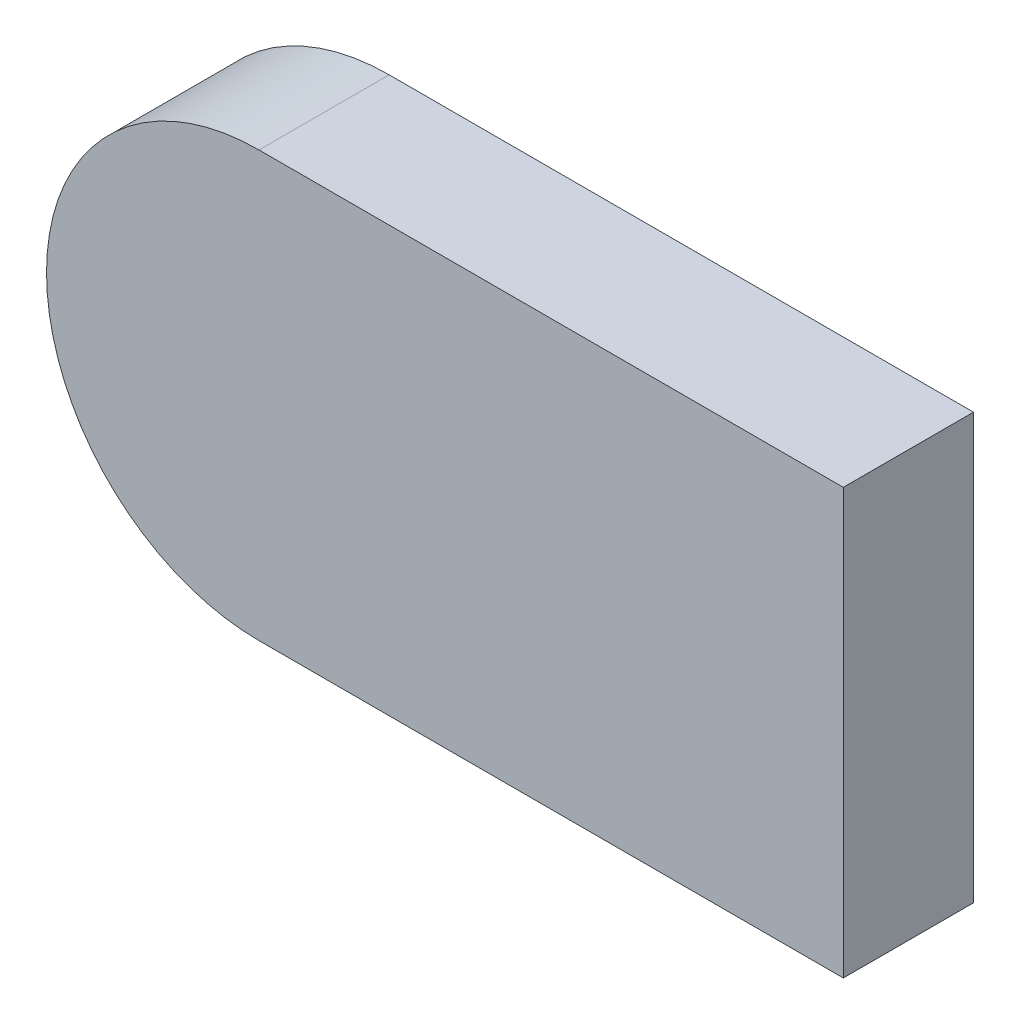
ISO-10303-21;
HEADER;
FILE_DESCRIPTION(('STEP AP214'),'2;1');
FILE_NAME('part.step','',(''),(''),'','','');
FILE_SCHEMA(('AUTOMOTIVE_DESIGN { 1 0 10303 214 1 1 1 1 }'));
ENDSEC;
DATA;
#1=APPLICATION_CONTEXT('core data for automotive mechanical design processes');
#2=APPLICATION_PROTOCOL_DEFINITION('international standard','automotive_design',2000,#1);
#3=PRODUCT_CONTEXT('',#1,'mechanical');
#4=PRODUCT('Part','Part','',(#3));
#5=PRODUCT_RELATED_PRODUCT_CATEGORY('part','',(#4));
#6=PRODUCT_DEFINITION_FORMATION('','',#4);
#7=PRODUCT_DEFINITION_CONTEXT('part definition',#1,'design');
#8=PRODUCT_DEFINITION('design','',#6,#7);
#9=PRODUCT_DEFINITION_SHAPE('','',#8);
#10=(LENGTH_UNIT() NAMED_UNIT(*) SI_UNIT(.MILLI.,.METRE.));
#11=(NAMED_UNIT(*) PLANE_ANGLE_UNIT() SI_UNIT($,.RADIAN.));
#12=(NAMED_UNIT(*) SI_UNIT($,.STERADIAN.) SOLID_ANGLE_UNIT());
#13=UNCERTAINTY_MEASURE_WITH_UNIT(LENGTH_MEASURE(1.E-05),#10,'distance_accuracy_value','');
#14=(GEOMETRIC_REPRESENTATION_CONTEXT(3) GLOBAL_UNCERTAINTY_ASSIGNED_CONTEXT((#13)) GLOBAL_UNIT_ASSIGNED_CONTEXT((#10,
#11,#12)) REPRESENTATION_CONTEXT('',''));
#15=CARTESIAN_POINT('',(0.,0.,0.));
#16=DIRECTION('',(0.,0.,1.));
#17=DIRECTION('',(1.,0.,0.));
#18=AXIS2_PLACEMENT_3D('',#15,#16,#17);
#19=CARTESIAN_POINT('',(0.,-22.5,-389.));
#20=DIRECTION('',(0.,0.,1.));
#21=DIRECTION('',(1.,0.,0.));
#22=AXIS2_PLACEMENT_3D('',#19,#20,#21);
#23=CYLINDRICAL_SURFACE('',#22,80.);
#24=DIRECTION('',(0.,0.,1.));
#25=VECTOR('',#24,1.);
#26=CARTESIAN_POINT('',(0.,57.5,-389.));
#27=LINE('',#26,#25);
#28=CARTESIAN_POINT('',(0.,57.5,-49.));
#29=VERTEX_POINT('',#28);
#30=CARTESIAN_POINT('',(0.,57.5,0.));
#31=VERTEX_POINT('',#30);
#32=EDGE_CURVE('E88',#29,#31,#27,.T.);
#33=ORIENTED_EDGE('',*,*,#32,.F.);
#34=CARTESIAN_POINT('',(0.,-22.5,-49.));
#35=DIRECTION('',(0.,0.,-1.));
#36=DIRECTION('',(-1.,0.,0.));
#37=AXIS2_PLACEMENT_3D('',#34,#35,#36);
#38=CIRCLE('',#37,80.);
#39=CARTESIAN_POINT('',(0.,-102.5,-49.));
#40=VERTEX_POINT('',#39);
#41=EDGE_CURVE('E105',#29,#40,#38,.F.);
#42=ORIENTED_EDGE('',*,*,#41,.T.);
#43=DIRECTION('',(0.,0.,1.));
#44=VECTOR('',#43,1.);
#45=CARTESIAN_POINT('',(0.,-102.5,-389.));
#46=LINE('',#45,#44);
#47=CARTESIAN_POINT('',(0.,-102.5,0.));
#48=VERTEX_POINT('',#47);
#49=EDGE_CURVE('E39',#40,#48,#46,.T.);
#50=ORIENTED_EDGE('',*,*,#49,.T.);
#51=CARTESIAN_POINT('',(0.,-22.5,0.));
#52=DIRECTION('',(0.,0.,1.));
#53=DIRECTION('',(1.,0.,0.));
#54=AXIS2_PLACEMENT_3D('',#51,#52,#53);
#55=CIRCLE('',#54,80.);
#56=EDGE_CURVE('E98',#31,#48,#55,.T.);
#57=ORIENTED_EDGE('',*,*,#56,.F.);
#58=EDGE_LOOP('',(#33,#42,#50,#57));
#59=FACE_BOUND('',#58,.T.);
#60=ADVANCED_FACE('F35',(#59),#23,.T.);
#61=CARTESIAN_POINT('',(0.,57.5,-389.));
#62=DIRECTION('',(0.,1.,0.));
#63=DIRECTION('',(-1.,0.,0.));
#64=AXIS2_PLACEMENT_3D('',#61,#62,#63);
#65=PLANE('',#64);
#66=DIRECTION('',(0.,0.,1.));
#67=VECTOR('',#66,1.);
#68=CARTESIAN_POINT('',(220.,57.5,-389.));
#69=LINE('',#68,#67);
#70=CARTESIAN_POINT('',(220.,57.5,-49.));
#71=VERTEX_POINT('',#70);
#72=CARTESIAN_POINT('',(220.,57.5,0.));
#73=VERTEX_POINT('',#72);
#74=EDGE_CURVE('E82',#71,#73,#69,.T.);
#75=ORIENTED_EDGE('',*,*,#74,.F.);
#76=DIRECTION('',(-1.,0.,0.));
#77=VECTOR('',#76,1.);
#78=CARTESIAN_POINT('',(0.,57.5,-49.));
#79=LINE('',#78,#77);
#80=EDGE_CURVE('E74',#71,#29,#79,.T.);
#81=ORIENTED_EDGE('',*,*,#80,.T.);
#82=ORIENTED_EDGE('',*,*,#32,.T.);
#83=DIRECTION('',(-1.,0.,0.));
#84=VECTOR('',#83,1.);
#85=CARTESIAN_POINT('',(0.,57.5,0.));
#86=LINE('',#85,#84);
#87=EDGE_CURVE('E94',#73,#31,#86,.T.);
#88=ORIENTED_EDGE('',*,*,#87,.F.);
#89=EDGE_LOOP('',(#75,#81,#82,#88));
#90=FACE_BOUND('',#89,.T.);
#91=ADVANCED_FACE('F97',(#90),#65,.T.);
#92=CARTESIAN_POINT('',(220.,0.,-389.));
#93=DIRECTION('',(-1.,0.,0.));
#94=DIRECTION('',(0.,-1.,0.));
#95=AXIS2_PLACEMENT_3D('',#92,#93,#94);
#96=PLANE('',#95);
#97=DIRECTION('',(0.,-1.,0.));
#98=VECTOR('',#97,1.);
#99=CARTESIAN_POINT('',(220.,0.,-49.));
#100=LINE('',#99,#98);
#101=CARTESIAN_POINT('',(220.,-102.5,-49.));
#102=VERTEX_POINT('',#101);
#103=EDGE_CURVE('E44',#71,#102,#100,.T.);
#104=ORIENTED_EDGE('',*,*,#103,.F.);
#105=ORIENTED_EDGE('',*,*,#74,.T.);
#106=DIRECTION('',(0.,-1.,0.));
#107=VECTOR('',#106,1.);
#108=CARTESIAN_POINT('',(220.,0.,0.));
#109=LINE('',#108,#107);
#110=CARTESIAN_POINT('',(220.,-102.5,0.));
#111=VERTEX_POINT('',#110);
#112=EDGE_CURVE('E85',#73,#111,#109,.T.);
#113=ORIENTED_EDGE('',*,*,#112,.T.);
#114=DIRECTION('',(0.,0.,1.));
#115=VECTOR('',#114,1.);
#116=CARTESIAN_POINT('',(220.,-102.5,-389.));
#117=LINE('',#116,#115);
#118=EDGE_CURVE('E57',#102,#111,#117,.T.);
#119=ORIENTED_EDGE('',*,*,#118,.F.);
#120=EDGE_LOOP('',(#104,#105,#113,#119));
#121=FACE_BOUND('',#120,.T.);
#122=ADVANCED_FACE('F84',(#121),#96,.F.);
#123=CARTESIAN_POINT('',(0.,-102.5,-389.));
#124=DIRECTION('',(0.,1.,0.));
#125=DIRECTION('',(-1.,0.,0.));
#126=AXIS2_PLACEMENT_3D('',#123,#124,#125);
#127=PLANE('',#126);
#128=DIRECTION('',(-1.,0.,0.));
#129=VECTOR('',#128,1.);
#130=CARTESIAN_POINT('',(0.,-102.5,-49.));
#131=LINE('',#130,#129);
#132=EDGE_CURVE('E11',#102,#40,#131,.T.);
#133=ORIENTED_EDGE('',*,*,#132,.F.);
#134=ORIENTED_EDGE('',*,*,#118,.T.);
#135=DIRECTION('',(-1.,0.,0.));
#136=VECTOR('',#135,1.);
#137=CARTESIAN_POINT('',(0.,-102.5,0.));
#138=LINE('',#137,#136);
#139=EDGE_CURVE('E95',#111,#48,#138,.T.);
#140=ORIENTED_EDGE('',*,*,#139,.T.);
#141=ORIENTED_EDGE('',*,*,#49,.F.);
#142=EDGE_LOOP('',(#133,#134,#140,#141));
#143=FACE_BOUND('',#142,.T.);
#144=ADVANCED_FACE('F109',(#143),#127,.F.);
#145=CARTESIAN_POINT('',(0.,0.,0.));
#146=DIRECTION('',(0.,0.,1.));
#147=DIRECTION('',(1.,0.,0.));
#148=AXIS2_PLACEMENT_3D('',#145,#146,#147);
#149=PLANE('',#148);
#150=ORIENTED_EDGE('',*,*,#56,.T.);
#151=ORIENTED_EDGE('',*,*,#139,.F.);
#152=ORIENTED_EDGE('',*,*,#112,.F.);
#153=ORIENTED_EDGE('',*,*,#87,.T.);
#154=EDGE_LOOP('',(#150,#151,#152,#153));
#155=FACE_BOUND('',#154,.T.);
#156=ADVANCED_FACE('F93',(#155),#149,.T.);
#157=CARTESIAN_POINT('',(0.,-22.5,-49.));
#158=DIRECTION('',(0.,0.,-1.));
#159=DIRECTION('',(0.,1.,0.));
#160=AXIS2_PLACEMENT_3D('',#157,#158,#159);
#161=PLANE('',#160);
#162=ORIENTED_EDGE('',*,*,#41,.F.);
#163=ORIENTED_EDGE('',*,*,#80,.F.);
#164=ORIENTED_EDGE('',*,*,#103,.T.);
#165=ORIENTED_EDGE('',*,*,#132,.T.);
#166=EDGE_LOOP('',(#162,#163,#164,#165));
#167=FACE_BOUND('',#166,.T.);
#168=ADVANCED_FACE('F37',(#167),#161,.T.);
#169=CLOSED_SHELL('',(#60,#91,#122,#144,#156,#168));
#170=MANIFOLD_SOLID_BREP('B2',#169);
#171=ADVANCED_BREP_SHAPE_REPRESENTATION('',(#18,#170),#14);
#172=SHAPE_DEFINITION_REPRESENTATION(#9,#171);
ENDSEC;
END-ISO-10303-21;
